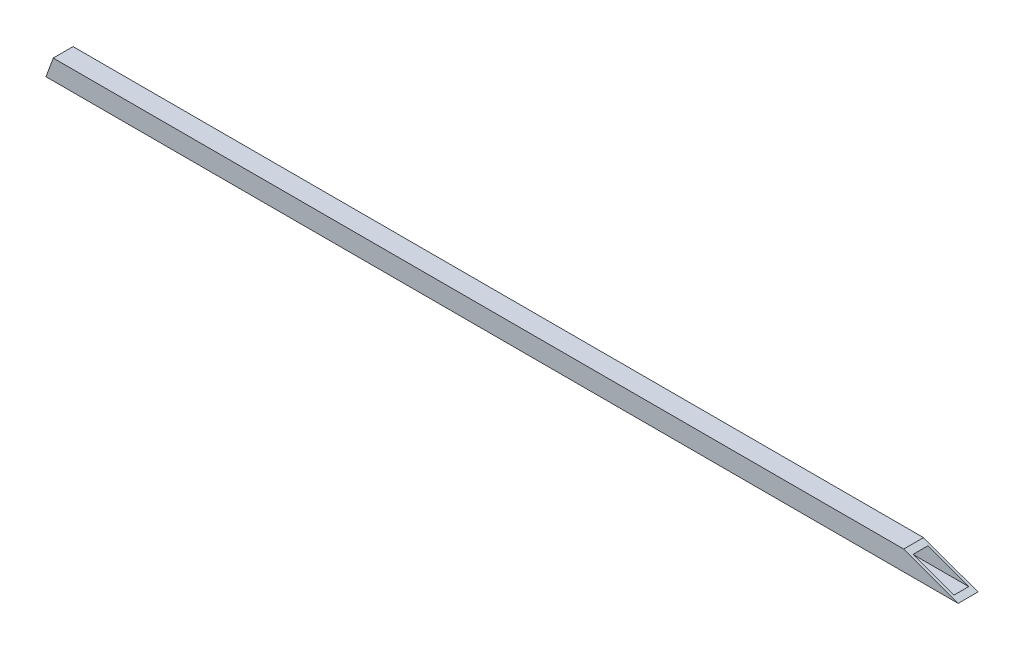
ISO-10303-21;
HEADER;
FILE_DESCRIPTION(('STEP AP214'),'2;1');
FILE_NAME('part.step','',(''),(''),'','','');
FILE_SCHEMA(('AUTOMOTIVE_DESIGN { 1 0 10303 214 1 1 1 1 }'));
ENDSEC;
DATA;
#1=APPLICATION_CONTEXT('core data for automotive mechanical design processes');
#2=APPLICATION_PROTOCOL_DEFINITION('international standard','automotive_design',2000,#1);
#3=PRODUCT_CONTEXT('',#1,'mechanical');
#4=PRODUCT('Part','Part','',(#3));
#5=PRODUCT_RELATED_PRODUCT_CATEGORY('part','',(#4));
#6=PRODUCT_DEFINITION_FORMATION('','',#4);
#7=PRODUCT_DEFINITION_CONTEXT('part definition',#1,'design');
#8=PRODUCT_DEFINITION('design','',#6,#7);
#9=PRODUCT_DEFINITION_SHAPE('','',#8);
#10=(LENGTH_UNIT() NAMED_UNIT(*) SI_UNIT(.MILLI.,.METRE.));
#11=(NAMED_UNIT(*) PLANE_ANGLE_UNIT() SI_UNIT($,.RADIAN.));
#12=(NAMED_UNIT(*) SI_UNIT($,.STERADIAN.) SOLID_ANGLE_UNIT());
#13=UNCERTAINTY_MEASURE_WITH_UNIT(LENGTH_MEASURE(1.E-05),#10,'distance_accuracy_value','');
#14=(GEOMETRIC_REPRESENTATION_CONTEXT(3) GLOBAL_UNCERTAINTY_ASSIGNED_CONTEXT((#13)) GLOBAL_UNIT_ASSIGNED_CONTEXT((#10,
#11,#12)) REPRESENTATION_CONTEXT('',''));
#15=CARTESIAN_POINT('',(0.,0.,0.));
#16=DIRECTION('',(0.,0.,1.));
#17=DIRECTION('',(1.,0.,0.));
#18=AXIS2_PLACEMENT_3D('',#15,#16,#17);
#19=CARTESIAN_POINT('',(-584.2,12.7,-12.7));
#20=DIRECTION('',(0.,1.,0.));
#21=DIRECTION('',(0.,0.,1.));
#22=AXIS2_PLACEMENT_3D('',#19,#20,#21);
#23=PLANE('',#22);
#24=DIRECTION('',(-1.,0.,0.));
#25=VECTOR('',#24,1.);
#26=CARTESIAN_POINT('',(-584.2,12.7,-12.7));
#27=LINE('',#26,#25);
#28=CARTESIAN_POINT('',(-574.955156049563,12.7000000000077,-12.7));
#29=VERTEX_POINT('',#28);
#30=CARTESIAN_POINT('',(514.41407354597,12.7,-12.7));
#31=VERTEX_POINT('',#30);
#32=EDGE_CURVE('E116',#29,#31,#27,.F.);
#33=ORIENTED_EDGE('',*,*,#32,.F.);
#34=DIRECTION('',(0.,0.,1.));
#35=VECTOR('',#34,1.);
#36=CARTESIAN_POINT('',(-574.955156049626,12.7000000000307,12.7));
#37=LINE('',#36,#35);
#38=CARTESIAN_POINT('',(-574.955156049563,12.7000000000077,12.7));
#39=VERTEX_POINT('',#38);
#40=EDGE_CURVE('E137',#29,#39,#37,.T.);
#41=ORIENTED_EDGE('',*,*,#40,.T.);
#42=DIRECTION('',(1.,0.,0.));
#43=VECTOR('',#42,1.);
#44=CARTESIAN_POINT('',(-584.2,12.7,12.7));
#45=LINE('',#44,#43);
#46=CARTESIAN_POINT('',(514.41407354597,12.7,12.7));
#47=VERTEX_POINT('',#46);
#48=EDGE_CURVE('E142',#47,#39,#45,.F.);
#49=ORIENTED_EDGE('',*,*,#48,.F.);
#50=DIRECTION('',(0.,0.,1.));
#51=VECTOR('',#50,1.);
#52=CARTESIAN_POINT('',(514.41407354597,12.7,12.7));
#53=LINE('',#52,#51);
#54=EDGE_CURVE('E113',#47,#31,#53,.F.);
#55=ORIENTED_EDGE('',*,*,#54,.T.);
#56=EDGE_LOOP('',(#33,#41,#49,#55));
#57=FACE_BOUND('',#56,.T.);
#58=ADVANCED_FACE('F17',(#57),#23,.T.);
#59=CARTESIAN_POINT('',(-584.2,9.525,9.525));
#60=DIRECTION('',(0.,-1.,0.));
#61=DIRECTION('',(0.,0.,-1.));
#62=AXIS2_PLACEMENT_3D('',#59,#60,#61);
#63=PLANE('',#62);
#64=DIRECTION('',(-1.,0.,0.));
#65=VECTOR('',#64,1.);
#66=CARTESIAN_POINT('',(-584.2,9.525,9.525));
#67=LINE('',#66,#65);
#68=CARTESIAN_POINT('',(-576.110761543491,9.52499999999397,9.525));
#69=VERTEX_POINT('',#68);
#70=CARTESIAN_POINT('',(523.137314352693,9.52500000000366,9.525));
#71=VERTEX_POINT('',#70);
#72=EDGE_CURVE('E82',#69,#71,#67,.F.);
#73=ORIENTED_EDGE('',*,*,#72,.F.);
#74=DIRECTION('',(0.,0.,1.));
#75=VECTOR('',#74,1.);
#76=CARTESIAN_POINT('',(-576.110761543442,9.52499999997586,12.7));
#77=LINE('',#76,#75);
#78=CARTESIAN_POINT('',(-576.110761543491,9.52499999999397,-9.525));
#79=VERTEX_POINT('',#78);
#80=EDGE_CURVE('E129',#69,#79,#77,.F.);
#81=ORIENTED_EDGE('',*,*,#80,.T.);
#82=DIRECTION('',(1.,0.,0.));
#83=VECTOR('',#82,1.);
#84=CARTESIAN_POINT('',(-584.2,9.525,-9.525));
#85=LINE('',#84,#83);
#86=CARTESIAN_POINT('',(523.137314352693,9.52500000000367,-9.525));
#87=VERTEX_POINT('',#86);
#88=EDGE_CURVE('E20',#87,#79,#85,.F.);
#89=ORIENTED_EDGE('',*,*,#88,.F.);
#90=DIRECTION('',(0.,0.,1.));
#91=VECTOR('',#90,1.);
#92=CARTESIAN_POINT('',(523.137314352697,9.52500000001466,12.7));
#93=LINE('',#92,#91);
#94=EDGE_CURVE('E79',#87,#71,#93,.T.);
#95=ORIENTED_EDGE('',*,*,#94,.T.);
#96=EDGE_LOOP('',(#73,#81,#89,#95));
#97=FACE_BOUND('',#96,.T.);
#98=ADVANCED_FACE('F81',(#97),#63,.T.);
#99=CARTESIAN_POINT('',(-584.2,9.525,-9.525));
#100=DIRECTION('',(0.,0.,1.));
#101=DIRECTION('',(1.,0.,0.));
#102=AXIS2_PLACEMENT_3D('',#99,#100,#101);
#103=PLANE('',#102);
#104=ORIENTED_EDGE('',*,*,#88,.T.);
#105=DIRECTION('',(0.342020143325699,0.939692620785897,0.));
#106=VECTOR('',#105,1.);
#107=CARTESIAN_POINT('',(-584.2,-12.7,-9.52500000000001));
#108=LINE('',#107,#106);
#109=CARTESIAN_POINT('',(-583.04439450627,-9.52500000000669,-9.525));
#110=VERTEX_POINT('',#109);
#111=EDGE_CURVE('E125',#79,#110,#108,.F.);
#112=ORIENTED_EDGE('',*,*,#111,.T.);
#113=DIRECTION('',(1.,0.,0.));
#114=VECTOR('',#113,1.);
#115=CARTESIAN_POINT('',(-584.2,-9.525,-9.525));
#116=LINE('',#115,#114);
#117=CARTESIAN_POINT('',(575.47675919328,-9.52499999999487,-9.525));
#118=VERTEX_POINT('',#117);
#119=EDGE_CURVE('E101',#118,#110,#116,.F.);
#120=ORIENTED_EDGE('',*,*,#119,.F.);
#121=DIRECTION('',(0.939692620785897,-0.342020143325699,0.));
#122=VECTOR('',#121,1.);
#123=CARTESIAN_POINT('',(514.41407354597,12.7,-9.52500000000001));
#124=LINE('',#123,#122);
#125=EDGE_CURVE('E108',#118,#87,#124,.F.);
#126=ORIENTED_EDGE('',*,*,#125,.T.);
#127=EDGE_LOOP('',(#104,#112,#120,#126));
#128=FACE_BOUND('',#127,.T.);
#129=ADVANCED_FACE('F124',(#128),#103,.T.);
#130=CARTESIAN_POINT('',(-584.2,-9.525,-9.525));
#131=DIRECTION('',(0.,1.,0.));
#132=DIRECTION('',(0.,0.,1.));
#133=AXIS2_PLACEMENT_3D('',#130,#131,#132);
#134=PLANE('',#133);
#135=ORIENTED_EDGE('',*,*,#119,.T.);
#136=DIRECTION('',(0.,0.,1.));
#137=VECTOR('',#136,1.);
#138=CARTESIAN_POINT('',(-583.044394506214,-9.52500000002678,12.7));
#139=LINE('',#138,#137);
#140=CARTESIAN_POINT('',(-583.04439450627,-9.52500000000669,9.525));
#141=VERTEX_POINT('',#140);
#142=EDGE_CURVE('E130',#110,#141,#139,.T.);
#143=ORIENTED_EDGE('',*,*,#142,.T.);
#144=DIRECTION('',(-1.,0.,0.));
#145=VECTOR('',#144,1.);
#146=CARTESIAN_POINT('',(-584.2,-9.525,9.525));
#147=LINE('',#146,#145);
#148=CARTESIAN_POINT('',(575.47675919328,-9.5249999999948,9.525));
#149=VERTEX_POINT('',#148);
#150=EDGE_CURVE('E100',#149,#141,#147,.T.);
#151=ORIENTED_EDGE('',*,*,#150,.F.);
#152=DIRECTION('',(0.,0.,1.));
#153=VECTOR('',#152,1.);
#154=CARTESIAN_POINT('',(575.476759193286,-9.52499999997915,12.7));
#155=LINE('',#154,#153);
#156=EDGE_CURVE('E106',#149,#118,#155,.F.);
#157=ORIENTED_EDGE('',*,*,#156,.T.);
#158=EDGE_LOOP('',(#135,#143,#151,#157));
#159=FACE_BOUND('',#158,.T.);
#160=ADVANCED_FACE('F173',(#159),#134,.T.);
#161=CARTESIAN_POINT('',(-584.2,-9.525,9.525));
#162=DIRECTION('',(0.,0.,-1.));
#163=DIRECTION('',(-1.,0.,0.));
#164=AXIS2_PLACEMENT_3D('',#161,#162,#163);
#165=PLANE('',#164);
#166=ORIENTED_EDGE('',*,*,#150,.T.);
#167=DIRECTION('',(0.342020143325699,0.939692620785897,0.));
#168=VECTOR('',#167,1.);
#169=CARTESIAN_POINT('',(-584.2,-12.7,9.525));
#170=LINE('',#169,#168);
#171=EDGE_CURVE('E98',#141,#69,#170,.T.);
#172=ORIENTED_EDGE('',*,*,#171,.T.);
#173=ORIENTED_EDGE('',*,*,#72,.T.);
#174=DIRECTION('',(0.939692620785897,-0.342020143325699,0.));
#175=VECTOR('',#174,1.);
#176=CARTESIAN_POINT('',(514.41407354597,12.7,9.525));
#177=LINE('',#176,#175);
#178=EDGE_CURVE('E89',#71,#149,#177,.T.);
#179=ORIENTED_EDGE('',*,*,#178,.T.);
#180=EDGE_LOOP('',(#166,#172,#173,#179));
#181=FACE_BOUND('',#180,.T.);
#182=ADVANCED_FACE('F95',(#181),#165,.T.);
#183=CARTESIAN_POINT('',(-584.2,-12.7,-12.7));
#184=DIRECTION('',(0.,0.,-1.));
#185=DIRECTION('',(-1.,0.,0.));
#186=AXIS2_PLACEMENT_3D('',#183,#184,#185);
#187=PLANE('',#186);
#188=DIRECTION('',(1.,0.,0.));
#189=VECTOR('',#188,1.);
#190=CARTESIAN_POINT('',(-584.2,-12.7,-12.7));
#191=LINE('',#190,#189);
#192=CARTESIAN_POINT('',(-584.2,-12.7,-12.7));
#193=VERTEX_POINT('',#192);
#194=CARTESIAN_POINT('',(584.200000000003,-12.6999999999911,-12.7));
#195=VERTEX_POINT('',#194);
#196=EDGE_CURVE('E160',#193,#195,#191,.T.);
#197=ORIENTED_EDGE('',*,*,#196,.F.);
#198=DIRECTION('',(0.342020143325699,0.939692620785897,0.));
#199=VECTOR('',#198,1.);
#200=CARTESIAN_POINT('',(-584.2,-12.7,-12.7));
#201=LINE('',#200,#199);
#202=EDGE_CURVE('E139',#193,#29,#201,.T.);
#203=ORIENTED_EDGE('',*,*,#202,.T.);
#204=ORIENTED_EDGE('',*,*,#32,.T.);
#205=DIRECTION('',(0.939692620785897,-0.342020143325699,0.));
#206=VECTOR('',#205,1.);
#207=CARTESIAN_POINT('',(514.41407354597,12.7,-12.7));
#208=LINE('',#207,#206);
#209=EDGE_CURVE('E90',#31,#195,#208,.T.);
#210=ORIENTED_EDGE('',*,*,#209,.T.);
#211=EDGE_LOOP('',(#197,#203,#204,#210));
#212=FACE_BOUND('',#211,.T.);
#213=ADVANCED_FACE('F164',(#212),#187,.T.);
#214=CARTESIAN_POINT('',(514.41407354597,12.7,12.7));
#215=DIRECTION('',(-0.342020143325699,-0.939692620785897,0.));
#216=DIRECTION('',(0.939692620785897,-0.342020143325699,0.));
#217=AXIS2_PLACEMENT_3D('',#214,#215,#216);
#218=PLANE('',#217);
#219=ORIENTED_EDGE('',*,*,#156,.F.);
#220=ORIENTED_EDGE('',*,*,#178,.F.);
#221=ORIENTED_EDGE('',*,*,#94,.F.);
#222=ORIENTED_EDGE('',*,*,#125,.F.);
#223=EDGE_LOOP('',(#219,#220,#221,#222));
#224=FACE_BOUND('',#223,.T.);
#225=ORIENTED_EDGE('',*,*,#54,.F.);
#226=DIRECTION('',(-0.939692620785723,0.342020143326177,0.));
#227=VECTOR('',#226,1.);
#228=CARTESIAN_POINT('',(584.2,-12.7,12.7));
#229=LINE('',#228,#227);
#230=CARTESIAN_POINT('',(584.200000000006,-12.6999999999822,12.7));
#231=VERTEX_POINT('',#230);
#232=EDGE_CURVE('E144',#231,#47,#229,.T.);
#233=ORIENTED_EDGE('',*,*,#232,.F.);
#234=DIRECTION('',(0.,0.,-1.));
#235=VECTOR('',#234,1.);
#236=CARTESIAN_POINT('',(584.2,-12.7,12.7));
#237=LINE('',#236,#235);
#238=EDGE_CURVE('E152',#195,#231,#237,.F.);
#239=ORIENTED_EDGE('',*,*,#238,.F.);
#240=ORIENTED_EDGE('',*,*,#209,.F.);
#241=EDGE_LOOP('',(#225,#233,#239,#240));
#242=FACE_BOUND('',#241,.T.);
#243=ADVANCED_FACE('F103',(#224,#242),#218,.F.);
#244=CARTESIAN_POINT('',(-584.2,12.7,12.7));
#245=DIRECTION('',(0.,0.,1.));
#246=DIRECTION('',(1.,0.,0.));
#247=AXIS2_PLACEMENT_3D('',#244,#245,#246);
#248=PLANE('',#247);
#249=ORIENTED_EDGE('',*,*,#48,.T.);
#250=DIRECTION('',(0.342020143325699,0.939692620785897,0.));
#251=VECTOR('',#250,1.);
#252=CARTESIAN_POINT('',(-584.2,-12.7,12.7));
#253=LINE('',#252,#251);
#254=CARTESIAN_POINT('',(-584.2,-12.7,12.7));
#255=VERTEX_POINT('',#254);
#256=EDGE_CURVE('E35',#39,#255,#253,.F.);
#257=ORIENTED_EDGE('',*,*,#256,.T.);
#258=DIRECTION('',(1.,0.,0.));
#259=VECTOR('',#258,1.);
#260=CARTESIAN_POINT('',(-584.2,-12.7,12.7));
#261=LINE('',#260,#259);
#262=EDGE_CURVE('E26',#231,#255,#261,.F.);
#263=ORIENTED_EDGE('',*,*,#262,.F.);
#264=ORIENTED_EDGE('',*,*,#232,.T.);
#265=EDGE_LOOP('',(#249,#257,#263,#264));
#266=FACE_BOUND('',#265,.T.);
#267=ADVANCED_FACE('F146',(#266),#248,.T.);
#268=CARTESIAN_POINT('',(-584.2,-12.7,12.7));
#269=DIRECTION('',(0.939692620785897,-0.342020143325699,0.));
#270=DIRECTION('',(0.342020143325699,0.939692620785897,0.));
#271=AXIS2_PLACEMENT_3D('',#268,#269,#270);
#272=PLANE('',#271);
#273=ORIENTED_EDGE('',*,*,#142,.F.);
#274=ORIENTED_EDGE('',*,*,#111,.F.);
#275=ORIENTED_EDGE('',*,*,#80,.F.);
#276=ORIENTED_EDGE('',*,*,#171,.F.);
#277=EDGE_LOOP('',(#273,#274,#275,#276));
#278=FACE_BOUND('',#277,.T.);
#279=ORIENTED_EDGE('',*,*,#40,.F.);
#280=ORIENTED_EDGE('',*,*,#202,.F.);
#281=DIRECTION('',(0.,0.,-1.));
#282=VECTOR('',#281,1.);
#283=CARTESIAN_POINT('',(-584.2,-12.7,12.7));
#284=LINE('',#283,#282);
#285=EDGE_CURVE('E11',#255,#193,#284,.T.);
#286=ORIENTED_EDGE('',*,*,#285,.F.);
#287=ORIENTED_EDGE('',*,*,#256,.F.);
#288=EDGE_LOOP('',(#279,#280,#286,#287));
#289=FACE_BOUND('',#288,.T.);
#290=ADVANCED_FACE('F127',(#278,#289),#272,.F.);
#291=CARTESIAN_POINT('',(-584.2,-12.7,12.7));
#292=DIRECTION('',(0.,-1.,0.));
#293=DIRECTION('',(0.,0.,-1.));
#294=AXIS2_PLACEMENT_3D('',#291,#292,#293);
#295=PLANE('',#294);
#296=ORIENTED_EDGE('',*,*,#262,.T.);
#297=ORIENTED_EDGE('',*,*,#285,.T.);
#298=ORIENTED_EDGE('',*,*,#196,.T.);
#299=ORIENTED_EDGE('',*,*,#238,.T.);
#300=EDGE_LOOP('',(#296,#297,#298,#299));
#301=FACE_BOUND('',#300,.T.);
#302=ADVANCED_FACE('F158',(#301),#295,.T.);
#303=CLOSED_SHELL('',(#58,#98,#129,#160,#182,#213,#243,#267,#290,#302));
#304=MANIFOLD_SOLID_BREP('B1',#303);
#305=ADVANCED_BREP_SHAPE_REPRESENTATION('',(#18,#304),#14);
#306=SHAPE_DEFINITION_REPRESENTATION(#9,#305);
ENDSEC;
END-ISO-10303-21;
